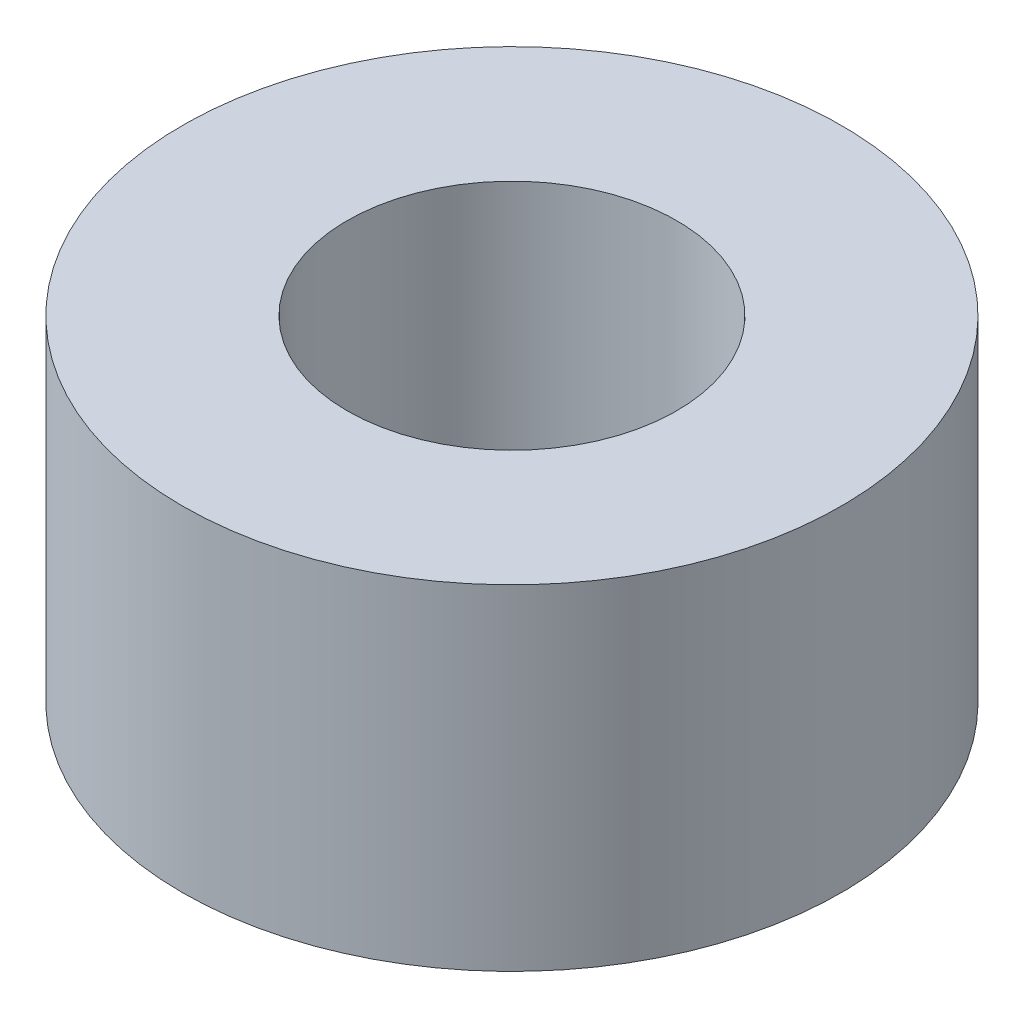
ISO-10303-21;
HEADER;
FILE_DESCRIPTION(('STEP AP214'),'2;1');
FILE_NAME('part.step','',(''),(''),'','','');
FILE_SCHEMA(('AUTOMOTIVE_DESIGN { 1 0 10303 214 1 1 1 1 }'));
ENDSEC;
DATA;
#1=APPLICATION_CONTEXT('core data for automotive mechanical design processes');
#2=APPLICATION_PROTOCOL_DEFINITION('international standard','automotive_design',2000,#1);
#3=PRODUCT_CONTEXT('',#1,'mechanical');
#4=PRODUCT('Part','Part','',(#3));
#5=PRODUCT_RELATED_PRODUCT_CATEGORY('part','',(#4));
#6=PRODUCT_DEFINITION_FORMATION('','',#4);
#7=PRODUCT_DEFINITION_CONTEXT('part definition',#1,'design');
#8=PRODUCT_DEFINITION('design','',#6,#7);
#9=PRODUCT_DEFINITION_SHAPE('','',#8);
#10=(LENGTH_UNIT() NAMED_UNIT(*) SI_UNIT(.MILLI.,.METRE.));
#11=(NAMED_UNIT(*) PLANE_ANGLE_UNIT() SI_UNIT($,.RADIAN.));
#12=(NAMED_UNIT(*) SI_UNIT($,.STERADIAN.) SOLID_ANGLE_UNIT());
#13=UNCERTAINTY_MEASURE_WITH_UNIT(LENGTH_MEASURE(1.E-05),#10,'distance_accuracy_value','');
#14=(GEOMETRIC_REPRESENTATION_CONTEXT(3) GLOBAL_UNCERTAINTY_ASSIGNED_CONTEXT((#13)) GLOBAL_UNIT_ASSIGNED_CONTEXT((#10,
#11,#12)) REPRESENTATION_CONTEXT('',''));
#15=CARTESIAN_POINT('',(0.,0.,0.));
#16=DIRECTION('',(0.,0.,1.));
#17=DIRECTION('',(1.,0.,0.));
#18=AXIS2_PLACEMENT_3D('',#15,#16,#17);
#19=CARTESIAN_POINT('',(0.,2.54,0.));
#20=DIRECTION('',(0.,-1.,0.));
#21=DIRECTION('',(0.,0.,-1.));
#22=AXIS2_PLACEMENT_3D('',#19,#20,#21);
#23=CYLINDRICAL_SURFACE('',#22,1.25);
#24=CARTESIAN_POINT('',(0.,2.54,0.));
#25=DIRECTION('',(0.,1.,0.));
#26=DIRECTION('',(0.,0.,1.));
#27=AXIS2_PLACEMENT_3D('',#24,#25,#26);
#28=CIRCLE('',#27,1.25);
#29=CARTESIAN_POINT('',(0.,2.54,1.25));
#30=VERTEX_POINT('',#29);
#31=EDGE_CURVE('E39',#30,#30,#28,.T.);
#32=ORIENTED_EDGE('',*,*,#31,.T.);
#33=EDGE_LOOP('',(#32));
#34=FACE_BOUND('',#33,.T.);
#35=CARTESIAN_POINT('',(0.,0.,0.));
#36=DIRECTION('',(0.,1.,0.));
#37=DIRECTION('',(0.,0.,1.));
#38=AXIS2_PLACEMENT_3D('',#35,#36,#37);
#39=CIRCLE('',#38,1.25);
#40=CARTESIAN_POINT('',(0.,0.,1.25));
#41=VERTEX_POINT('',#40);
#42=EDGE_CURVE('E45',#41,#41,#39,.T.);
#43=ORIENTED_EDGE('',*,*,#42,.F.);
#44=EDGE_LOOP('',(#43));
#45=FACE_BOUND('',#44,.T.);
#46=ADVANCED_FACE('F32',(#34,#45),#23,.F.);
#47=CARTESIAN_POINT('',(0.,2.54,0.));
#48=DIRECTION('',(0.,-1.,0.));
#49=DIRECTION('',(0.,0.,-1.));
#50=AXIS2_PLACEMENT_3D('',#47,#48,#49);
#51=CYLINDRICAL_SURFACE('',#50,2.5);
#52=CARTESIAN_POINT('',(0.,2.54,0.));
#53=DIRECTION('',(0.,1.,0.));
#54=DIRECTION('',(0.,0.,1.));
#55=AXIS2_PLACEMENT_3D('',#52,#53,#54);
#56=CIRCLE('',#55,2.5);
#57=CARTESIAN_POINT('',(0.,2.54,2.5));
#58=VERTEX_POINT('',#57);
#59=EDGE_CURVE('E10',#58,#58,#56,.T.);
#60=ORIENTED_EDGE('',*,*,#59,.F.);
#61=EDGE_LOOP('',(#60));
#62=FACE_BOUND('',#61,.T.);
#63=CARTESIAN_POINT('',(0.,0.,0.));
#64=DIRECTION('',(0.,1.,0.));
#65=DIRECTION('',(0.,0.,1.));
#66=AXIS2_PLACEMENT_3D('',#63,#64,#65);
#67=CIRCLE('',#66,2.5);
#68=CARTESIAN_POINT('',(0.,0.,2.5));
#69=VERTEX_POINT('',#68);
#70=EDGE_CURVE('E35',#69,#69,#67,.T.);
#71=ORIENTED_EDGE('',*,*,#70,.T.);
#72=EDGE_LOOP('',(#71));
#73=FACE_BOUND('',#72,.T.);
#74=ADVANCED_FACE('F52',(#62,#73),#51,.T.);
#75=CARTESIAN_POINT('',(0.,2.54,0.));
#76=DIRECTION('',(0.,1.,0.));
#77=DIRECTION('',(0.,0.,1.));
#78=AXIS2_PLACEMENT_3D('',#75,#76,#77);
#79=PLANE('',#78);
#80=ORIENTED_EDGE('',*,*,#31,.F.);
#81=EDGE_LOOP('',(#80));
#82=FACE_BOUND('',#81,.T.);
#83=ORIENTED_EDGE('',*,*,#59,.T.);
#84=EDGE_LOOP('',(#83));
#85=FACE_BOUND('',#84,.T.);
#86=ADVANCED_FACE('F56',(#82,#85),#79,.T.);
#87=CARTESIAN_POINT('',(0.,0.,0.));
#88=DIRECTION('',(0.,1.,0.));
#89=DIRECTION('',(0.,0.,1.));
#90=AXIS2_PLACEMENT_3D('',#87,#88,#89);
#91=PLANE('',#90);
#92=ORIENTED_EDGE('',*,*,#42,.T.);
#93=EDGE_LOOP('',(#92));
#94=FACE_BOUND('',#93,.T.);
#95=ORIENTED_EDGE('',*,*,#70,.F.);
#96=EDGE_LOOP('',(#95));
#97=FACE_BOUND('',#96,.T.);
#98=ADVANCED_FACE('F54',(#94,#97),#91,.F.);
#99=CLOSED_SHELL('',(#46,#74,#86,#98));
#100=MANIFOLD_SOLID_BREP('B2',#99);
#101=ADVANCED_BREP_SHAPE_REPRESENTATION('',(#18,#100),#14);
#102=SHAPE_DEFINITION_REPRESENTATION(#9,#101);
ENDSEC;
END-ISO-10303-21;
